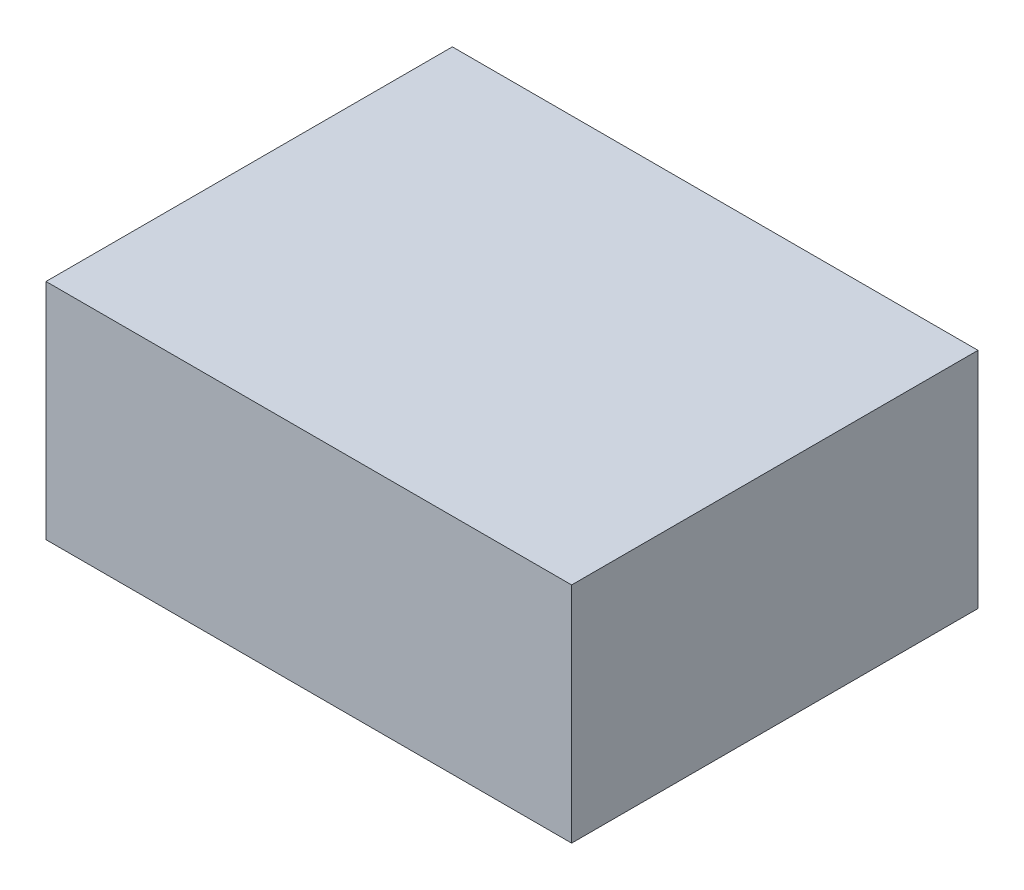
ISO-10303-21;
HEADER;
FILE_DESCRIPTION(('STEP AP214'),'2;1');
FILE_NAME('part.step','',(''),(''),'','','');
FILE_SCHEMA(('AUTOMOTIVE_DESIGN { 1 0 10303 214 1 1 1 1 }'));
ENDSEC;
DATA;
#1=APPLICATION_CONTEXT('core data for automotive mechanical design processes');
#2=APPLICATION_PROTOCOL_DEFINITION('international standard','automotive_design',2000,#1);
#3=PRODUCT_CONTEXT('',#1,'mechanical');
#4=PRODUCT('Part','Part','',(#3));
#5=PRODUCT_RELATED_PRODUCT_CATEGORY('part','',(#4));
#6=PRODUCT_DEFINITION_FORMATION('','',#4);
#7=PRODUCT_DEFINITION_CONTEXT('part definition',#1,'design');
#8=PRODUCT_DEFINITION('design','',#6,#7);
#9=PRODUCT_DEFINITION_SHAPE('','',#8);
#10=(LENGTH_UNIT() NAMED_UNIT(*) SI_UNIT(.MILLI.,.METRE.));
#11=(NAMED_UNIT(*) PLANE_ANGLE_UNIT() SI_UNIT($,.RADIAN.));
#12=(NAMED_UNIT(*) SI_UNIT($,.STERADIAN.) SOLID_ANGLE_UNIT());
#13=UNCERTAINTY_MEASURE_WITH_UNIT(LENGTH_MEASURE(1.E-05),#10,'distance_accuracy_value','');
#14=(GEOMETRIC_REPRESENTATION_CONTEXT(3) GLOBAL_UNCERTAINTY_ASSIGNED_CONTEXT((#13)) GLOBAL_UNIT_ASSIGNED_CONTEXT((#10,
#11,#12)) REPRESENTATION_CONTEXT('',''));
#15=CARTESIAN_POINT('',(0.,0.,0.));
#16=DIRECTION('',(0.,0.,1.));
#17=DIRECTION('',(1.,0.,0.));
#18=AXIS2_PLACEMENT_3D('',#15,#16,#17);
#19=CARTESIAN_POINT('',(0.,46.5,0.));
#20=DIRECTION('',(1.,0.,0.));
#21=DIRECTION('',(0.,0.,-1.));
#22=AXIS2_PLACEMENT_3D('',#19,#20,#21);
#23=PLANE('',#22);
#24=DIRECTION('',(0.,0.,1.));
#25=VECTOR('',#24,1.);
#26=CARTESIAN_POINT('',(0.,0.,0.));
#27=LINE('',#26,#25);
#28=CARTESIAN_POINT('',(0.,0.,-84.5));
#29=VERTEX_POINT('',#28);
#30=CARTESIAN_POINT('',(0.,0.,0.));
#31=VERTEX_POINT('',#30);
#32=EDGE_CURVE('E96',#29,#31,#27,.T.);
#33=ORIENTED_EDGE('',*,*,#32,.T.);
#34=DIRECTION('',(0.,-1.,0.));
#35=VECTOR('',#34,1.);
#36=CARTESIAN_POINT('',(0.,46.5,0.));
#37=LINE('',#36,#35);
#38=CARTESIAN_POINT('',(0.,46.5,0.));
#39=VERTEX_POINT('',#38);
#40=EDGE_CURVE('E11',#39,#31,#37,.T.);
#41=ORIENTED_EDGE('',*,*,#40,.F.);
#42=DIRECTION('',(0.,0.,1.));
#43=VECTOR('',#42,1.);
#44=CARTESIAN_POINT('',(0.,46.5,0.));
#45=LINE('',#44,#43);
#46=CARTESIAN_POINT('',(0.,46.5,-84.5));
#47=VERTEX_POINT('',#46);
#48=EDGE_CURVE('E84',#47,#39,#45,.T.);
#49=ORIENTED_EDGE('',*,*,#48,.F.);
#50=DIRECTION('',(0.,-1.,0.));
#51=VECTOR('',#50,1.);
#52=CARTESIAN_POINT('',(0.,46.5,-84.5));
#53=LINE('',#52,#51);
#54=EDGE_CURVE('E92',#47,#29,#53,.T.);
#55=ORIENTED_EDGE('',*,*,#54,.T.);
#56=EDGE_LOOP('',(#33,#41,#49,#55));
#57=FACE_BOUND('',#56,.T.);
#58=ADVANCED_FACE('F33',(#57),#23,.F.);
#59=CARTESIAN_POINT('',(0.,46.5,0.));
#60=DIRECTION('',(0.,0.,-1.));
#61=DIRECTION('',(-1.,0.,0.));
#62=AXIS2_PLACEMENT_3D('',#59,#60,#61);
#63=PLANE('',#62);
#64=DIRECTION('',(1.,0.,0.));
#65=VECTOR('',#64,1.);
#66=CARTESIAN_POINT('',(0.,0.,0.));
#67=LINE('',#66,#65);
#68=CARTESIAN_POINT('',(109.3,0.,0.));
#69=VERTEX_POINT('',#68);
#70=EDGE_CURVE('E88',#31,#69,#67,.T.);
#71=ORIENTED_EDGE('',*,*,#70,.T.);
#72=DIRECTION('',(0.,-1.,0.));
#73=VECTOR('',#72,1.);
#74=CARTESIAN_POINT('',(109.3,46.5,0.));
#75=LINE('',#74,#73);
#76=CARTESIAN_POINT('',(109.3,46.5,0.));
#77=VERTEX_POINT('',#76);
#78=EDGE_CURVE('E41',#77,#69,#75,.T.);
#79=ORIENTED_EDGE('',*,*,#78,.F.);
#80=DIRECTION('',(1.,0.,0.));
#81=VECTOR('',#80,1.);
#82=CARTESIAN_POINT('',(0.,46.5,0.));
#83=LINE('',#82,#81);
#84=EDGE_CURVE('E79',#39,#77,#83,.T.);
#85=ORIENTED_EDGE('',*,*,#84,.F.);
#86=ORIENTED_EDGE('',*,*,#40,.T.);
#87=EDGE_LOOP('',(#71,#79,#85,#86));
#88=FACE_BOUND('',#87,.T.);
#89=ADVANCED_FACE('F87',(#88),#63,.F.);
#90=CARTESIAN_POINT('',(109.3,46.5,0.));
#91=DIRECTION('',(-1.,0.,0.));
#92=DIRECTION('',(0.,0.,1.));
#93=AXIS2_PLACEMENT_3D('',#90,#91,#92);
#94=PLANE('',#93);
#95=DIRECTION('',(0.,0.,-1.));
#96=VECTOR('',#95,1.);
#97=CARTESIAN_POINT('',(109.3,0.,0.));
#98=LINE('',#97,#96);
#99=CARTESIAN_POINT('',(109.3,0.,-84.5));
#100=VERTEX_POINT('',#99);
#101=EDGE_CURVE('E66',#69,#100,#98,.T.);
#102=ORIENTED_EDGE('',*,*,#101,.T.);
#103=DIRECTION('',(0.,-1.,0.));
#104=VECTOR('',#103,1.);
#105=CARTESIAN_POINT('',(109.3,46.5,-84.5));
#106=LINE('',#105,#104);
#107=CARTESIAN_POINT('',(109.3,46.5,-84.5));
#108=VERTEX_POINT('',#107);
#109=EDGE_CURVE('E89',#108,#100,#106,.T.);
#110=ORIENTED_EDGE('',*,*,#109,.F.);
#111=DIRECTION('',(0.,0.,-1.));
#112=VECTOR('',#111,1.);
#113=CARTESIAN_POINT('',(109.3,46.5,0.));
#114=LINE('',#113,#112);
#115=EDGE_CURVE('E82',#77,#108,#114,.T.);
#116=ORIENTED_EDGE('',*,*,#115,.F.);
#117=ORIENTED_EDGE('',*,*,#78,.T.);
#118=EDGE_LOOP('',(#102,#110,#116,#117));
#119=FACE_BOUND('',#118,.T.);
#120=ADVANCED_FACE('F90',(#119),#94,.F.);
#121=CARTESIAN_POINT('',(0.,46.5,-84.5));
#122=DIRECTION('',(0.,0.,1.));
#123=DIRECTION('',(1.,0.,0.));
#124=AXIS2_PLACEMENT_3D('',#121,#122,#123);
#125=PLANE('',#124);
#126=DIRECTION('',(-1.,0.,0.));
#127=VECTOR('',#126,1.);
#128=CARTESIAN_POINT('',(0.,0.,-84.5));
#129=LINE('',#128,#127);
#130=EDGE_CURVE('E72',#100,#29,#129,.T.);
#131=ORIENTED_EDGE('',*,*,#130,.T.);
#132=ORIENTED_EDGE('',*,*,#54,.F.);
#133=DIRECTION('',(-1.,0.,0.));
#134=VECTOR('',#133,1.);
#135=CARTESIAN_POINT('',(0.,46.5,-84.5));
#136=LINE('',#135,#134);
#137=EDGE_CURVE('E49',#108,#47,#136,.T.);
#138=ORIENTED_EDGE('',*,*,#137,.F.);
#139=ORIENTED_EDGE('',*,*,#109,.T.);
#140=EDGE_LOOP('',(#131,#132,#138,#139));
#141=FACE_BOUND('',#140,.T.);
#142=ADVANCED_FACE('F103',(#141),#125,.F.);
#143=CARTESIAN_POINT('',(0.,46.5,0.));
#144=DIRECTION('',(0.,-1.,0.));
#145=DIRECTION('',(0.,0.,-1.));
#146=AXIS2_PLACEMENT_3D('',#143,#144,#145);
#147=PLANE('',#146);
#148=ORIENTED_EDGE('',*,*,#48,.T.);
#149=ORIENTED_EDGE('',*,*,#84,.T.);
#150=ORIENTED_EDGE('',*,*,#115,.T.);
#151=ORIENTED_EDGE('',*,*,#137,.T.);
#152=EDGE_LOOP('',(#148,#149,#150,#151));
#153=FACE_BOUND('',#152,.T.);
#154=ADVANCED_FACE('F80',(#153),#147,.F.);
#155=CARTESIAN_POINT('',(0.,0.,0.));
#156=DIRECTION('',(0.,-1.,0.));
#157=DIRECTION('',(0.,0.,-1.));
#158=AXIS2_PLACEMENT_3D('',#155,#156,#157);
#159=PLANE('',#158);
#160=ORIENTED_EDGE('',*,*,#32,.F.);
#161=ORIENTED_EDGE('',*,*,#130,.F.);
#162=ORIENTED_EDGE('',*,*,#101,.F.);
#163=ORIENTED_EDGE('',*,*,#70,.F.);
#164=EDGE_LOOP('',(#160,#161,#162,#163));
#165=FACE_BOUND('',#164,.T.);
#166=ADVANCED_FACE('F106',(#165),#159,.T.);
#167=CLOSED_SHELL('',(#58,#89,#120,#142,#154,#166));
#168=MANIFOLD_SOLID_BREP('B2',#167);
#169=ADVANCED_BREP_SHAPE_REPRESENTATION('',(#18,#168),#14);
#170=SHAPE_DEFINITION_REPRESENTATION(#9,#169);
ENDSEC;
END-ISO-10303-21;
